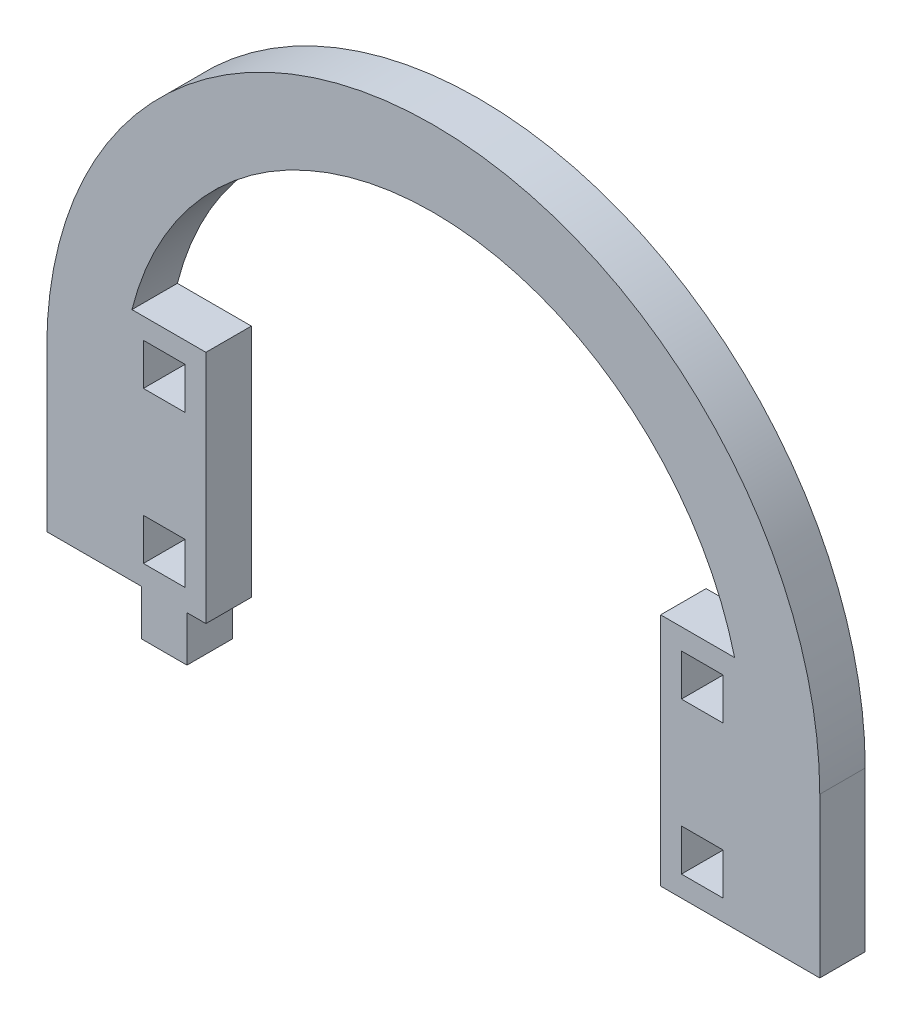
ISO-10303-21;
HEADER;
FILE_DESCRIPTION(('STEP AP214'),'2;1');
FILE_NAME('part.step','',(''),(''),'','','');
FILE_SCHEMA(('AUTOMOTIVE_DESIGN { 1 0 10303 214 1 1 1 1 }'));
ENDSEC;
DATA;
#1=APPLICATION_CONTEXT('core data for automotive mechanical design processes');
#2=APPLICATION_PROTOCOL_DEFINITION('international standard','automotive_design',2000,#1);
#3=PRODUCT_CONTEXT('',#1,'mechanical');
#4=PRODUCT('Part','Part','',(#3));
#5=PRODUCT_RELATED_PRODUCT_CATEGORY('part','',(#4));
#6=PRODUCT_DEFINITION_FORMATION('','',#4);
#7=PRODUCT_DEFINITION_CONTEXT('part definition',#1,'design');
#8=PRODUCT_DEFINITION('design','',#6,#7);
#9=PRODUCT_DEFINITION_SHAPE('','',#8);
#10=(LENGTH_UNIT() NAMED_UNIT(*) SI_UNIT(.MILLI.,.METRE.));
#11=(NAMED_UNIT(*) PLANE_ANGLE_UNIT() SI_UNIT($,.RADIAN.));
#12=(NAMED_UNIT(*) SI_UNIT($,.STERADIAN.) SOLID_ANGLE_UNIT());
#13=UNCERTAINTY_MEASURE_WITH_UNIT(LENGTH_MEASURE(1.E-05),#10,'distance_accuracy_value','');
#14=(GEOMETRIC_REPRESENTATION_CONTEXT(3) GLOBAL_UNCERTAINTY_ASSIGNED_CONTEXT((#13)) GLOBAL_UNIT_ASSIGNED_CONTEXT((#10,
#11,#12)) REPRESENTATION_CONTEXT('',''));
#15=CARTESIAN_POINT('',(0.,0.,0.));
#16=DIRECTION('',(0.,0.,1.));
#17=DIRECTION('',(1.,0.,0.));
#18=AXIS2_PLACEMENT_3D('',#15,#16,#17);
#19=CARTESIAN_POINT('',(3464.84300206341,1402.04996932109,6.));
#20=DIRECTION('',(0.,0.,1.));
#21=DIRECTION('',(1.,0.,0.));
#22=AXIS2_PLACEMENT_3D('',#19,#20,#21);
#23=PLANE('',#22);
#24=CARTESIAN_POINT('',(3464.84300206341,1402.04996932109,6.));
#25=DIRECTION('',(0.,0.,1.));
#26=DIRECTION('',(1.,0.,0.));
#27=AXIS2_PLACEMENT_3D('',#24,#25,#26);
#28=CIRCLE('',#27,51.0000000000002);
#29=CARTESIAN_POINT('',(3515.84300206341,1402.04996932109,6.));
#30=VERTEX_POINT('',#29);
#31=CARTESIAN_POINT('',(3413.84300206341,1402.04996932109,6.));
#32=VERTEX_POINT('',#31);
#33=EDGE_CURVE('E642',#30,#32,#28,.T.);
#34=ORIENTED_EDGE('',*,*,#33,.T.);
#35=DIRECTION('',(0.,-1.,0.));
#36=VECTOR('',#35,1.);
#37=CARTESIAN_POINT('',(3413.84300206341,1402.04996932109,6.));
#38=LINE('',#37,#36);
#39=CARTESIAN_POINT('',(3413.84300206341,1381.04996932109,6.));
#40=VERTEX_POINT('',#39);
#41=EDGE_CURVE('E646',#32,#40,#38,.T.);
#42=ORIENTED_EDGE('',*,*,#41,.T.);
#43=DIRECTION('',(1.,0.,0.));
#44=VECTOR('',#43,1.);
#45=CARTESIAN_POINT('',(3413.84300206341,1381.04996932109,6.));
#46=LINE('',#45,#44);
#47=CARTESIAN_POINT('',(3426.34300206341,1381.04996932109,6.));
#48=VERTEX_POINT('',#47);
#49=EDGE_CURVE('E650',#40,#48,#46,.T.);
#50=ORIENTED_EDGE('',*,*,#49,.T.);
#51=DIRECTION('',(0.,-1.,0.));
#52=VECTOR('',#51,1.);
#53=CARTESIAN_POINT('',(3426.34300206341,1381.04996932109,6.));
#54=LINE('',#53,#52);
#55=CARTESIAN_POINT('',(3426.34300206341,1375.04996932109,6.));
#56=VERTEX_POINT('',#55);
#57=EDGE_CURVE('E653',#48,#56,#54,.T.);
#58=ORIENTED_EDGE('',*,*,#57,.T.);
#59=DIRECTION('',(1.,0.,0.));
#60=VECTOR('',#59,1.);
#61=CARTESIAN_POINT('',(3426.34300206341,1375.04996932109,6.));
#62=LINE('',#61,#60);
#63=CARTESIAN_POINT('',(3432.34300206341,1375.04996932109,6.));
#64=VERTEX_POINT('',#63);
#65=EDGE_CURVE('E656',#56,#64,#62,.T.);
#66=ORIENTED_EDGE('',*,*,#65,.T.);
#67=DIRECTION('',(0.,1.,0.));
#68=VECTOR('',#67,1.);
#69=CARTESIAN_POINT('',(3432.34300206341,1375.04996932109,6.));
#70=LINE('',#69,#68);
#71=CARTESIAN_POINT('',(3432.34300206341,1381.04996932109,6.));
#72=VERTEX_POINT('',#71);
#73=EDGE_CURVE('E659',#64,#72,#70,.T.);
#74=ORIENTED_EDGE('',*,*,#73,.T.);
#75=DIRECTION('',(1.,0.,0.));
#76=VECTOR('',#75,1.);
#77=CARTESIAN_POINT('',(3432.34300206341,1381.04996932109,6.));
#78=LINE('',#77,#76);
#79=CARTESIAN_POINT('',(3434.84300206341,1381.04996932109,6.));
#80=VERTEX_POINT('',#79);
#81=EDGE_CURVE('E662',#72,#80,#78,.T.);
#82=ORIENTED_EDGE('',*,*,#81,.T.);
#83=DIRECTION('',(0.,-1.,0.));
#84=VECTOR('',#83,1.);
#85=CARTESIAN_POINT('',(3434.84300206341,1412.04996932109,6.));
#86=LINE('',#85,#84);
#87=CARTESIAN_POINT('',(3434.84300206341,1412.04996932109,6.));
#88=VERTEX_POINT('',#87);
#89=EDGE_CURVE('E665',#88,#80,#86,.T.);
#90=ORIENTED_EDGE('',*,*,#89,.F.);
#91=DIRECTION('',(-1.,0.,0.));
#92=VECTOR('',#91,1.);
#93=CARTESIAN_POINT('',(3434.84300206341,1412.04996932109,6.));
#94=LINE('',#93,#92);
#95=CARTESIAN_POINT('',(3425.08121135927,1412.04996932109,6.));
#96=VERTEX_POINT('',#95);
#97=EDGE_CURVE('E669',#88,#96,#94,.T.);
#98=ORIENTED_EDGE('',*,*,#97,.T.);
#99=CARTESIAN_POINT('',(3464.84300206341,1402.04996932109,6.));
#100=DIRECTION('',(0.,0.,1.));
#101=DIRECTION('',(1.,0.,0.));
#102=AXIS2_PLACEMENT_3D('',#99,#100,#101);
#103=CIRCLE('',#102,41.);
#104=CARTESIAN_POINT('',(3504.60479276755,1412.04996932109,6.));
#105=VERTEX_POINT('',#104);
#106=EDGE_CURVE('E672',#105,#96,#103,.T.);
#107=ORIENTED_EDGE('',*,*,#106,.F.);
#108=DIRECTION('',(-1.,0.,0.));
#109=VECTOR('',#108,1.);
#110=CARTESIAN_POINT('',(3504.60479276755,1412.04996932109,6.));
#111=LINE('',#110,#109);
#112=CARTESIAN_POINT('',(3494.84300206341,1412.04996932109,6.));
#113=VERTEX_POINT('',#112);
#114=EDGE_CURVE('E676',#105,#113,#111,.T.);
#115=ORIENTED_EDGE('',*,*,#114,.T.);
#116=DIRECTION('',(0.,-1.,0.));
#117=VECTOR('',#116,1.);
#118=CARTESIAN_POINT('',(3494.84300206341,1412.04996932109,6.));
#119=LINE('',#118,#117);
#120=CARTESIAN_POINT('',(3494.84300206341,1381.04996932109,6.));
#121=VERTEX_POINT('',#120);
#122=EDGE_CURVE('E679',#113,#121,#119,.T.);
#123=ORIENTED_EDGE('',*,*,#122,.T.);
#124=DIRECTION('',(1.,0.,0.));
#125=VECTOR('',#124,1.);
#126=CARTESIAN_POINT('',(3494.84300206341,1381.04996932109,6.));
#127=LINE('',#126,#125);
#128=CARTESIAN_POINT('',(3515.84300206341,1381.04996932109,6.));
#129=VERTEX_POINT('',#128);
#130=EDGE_CURVE('E682',#121,#129,#127,.T.);
#131=ORIENTED_EDGE('',*,*,#130,.T.);
#132=DIRECTION('',(0.,-1.,0.));
#133=VECTOR('',#132,1.);
#134=CARTESIAN_POINT('',(3515.84300206341,1402.04996932109,6.));
#135=LINE('',#134,#133);
#136=EDGE_CURVE('E685',#30,#129,#135,.T.);
#137=ORIENTED_EDGE('',*,*,#136,.F.);
#138=EDGE_LOOP('',(#34,#42,#50,#58,#66,#74,#82,#90,#98,#107,#115,#123,#131,#137));
#139=FACE_BOUND('',#138,.T.);
#140=DIRECTION('',(0.,1.,0.));
#141=VECTOR('',#140,1.);
#142=CARTESIAN_POINT('',(3432.09300206341,0.,6.));
#143=LINE('',#142,#141);
#144=CARTESIAN_POINT('',(3432.09300206341,1403.79996932109,6.));
#145=VERTEX_POINT('',#144);
#146=CARTESIAN_POINT('',(3432.09300206341,1409.29996932109,6.));
#147=VERTEX_POINT('',#146);
#148=EDGE_CURVE('E602',#145,#147,#143,.T.);
#149=ORIENTED_EDGE('',*,*,#148,.F.);
#150=DIRECTION('',(1.,0.,0.));
#151=VECTOR('',#150,1.);
#152=CARTESIAN_POINT('',(0.,1403.79996932109,6.));
#153=LINE('',#152,#151);
#154=CARTESIAN_POINT('',(3426.59300206341,1403.79996932109,6.));
#155=VERTEX_POINT('',#154);
#156=EDGE_CURVE('E599',#155,#145,#153,.T.);
#157=ORIENTED_EDGE('',*,*,#156,.F.);
#158=DIRECTION('',(0.,-1.,0.));
#159=VECTOR('',#158,1.);
#160=CARTESIAN_POINT('',(3426.59300206341,0.,6.));
#161=LINE('',#160,#159);
#162=CARTESIAN_POINT('',(3426.59300206341,1409.29996932109,6.));
#163=VERTEX_POINT('',#162);
#164=EDGE_CURVE('E610',#163,#155,#161,.T.);
#165=ORIENTED_EDGE('',*,*,#164,.F.);
#166=DIRECTION('',(-1.,0.,0.));
#167=VECTOR('',#166,1.);
#168=CARTESIAN_POINT('',(0.,1409.29996932109,6.));
#169=LINE('',#168,#167);
#170=EDGE_CURVE('E606',#147,#163,#169,.T.);
#171=ORIENTED_EDGE('',*,*,#170,.F.);
#172=EDGE_LOOP('',(#149,#157,#165,#171));
#173=FACE_BOUND('',#172,.T.);
#174=DIRECTION('',(0.,1.,0.));
#175=VECTOR('',#174,1.);
#176=CARTESIAN_POINT('',(3503.09300206341,0.,6.));
#177=LINE('',#176,#175);
#178=CARTESIAN_POINT('',(3503.09300206341,1383.79996932109,6.));
#179=VERTEX_POINT('',#178);
#180=CARTESIAN_POINT('',(3503.09300206341,1389.29996932109,6.));
#181=VERTEX_POINT('',#180);
#182=EDGE_CURVE('E559',#179,#181,#177,.T.);
#183=ORIENTED_EDGE('',*,*,#182,.F.);
#184=DIRECTION('',(1.,0.,0.));
#185=VECTOR('',#184,1.);
#186=CARTESIAN_POINT('',(0.,1383.79996932109,6.));
#187=LINE('',#186,#185);
#188=CARTESIAN_POINT('',(3497.59300206341,1383.79996932109,6.));
#189=VERTEX_POINT('',#188);
#190=EDGE_CURVE('E556',#189,#179,#187,.T.);
#191=ORIENTED_EDGE('',*,*,#190,.F.);
#192=DIRECTION('',(0.,-1.,0.));
#193=VECTOR('',#192,1.);
#194=CARTESIAN_POINT('',(3497.59300206341,0.,6.));
#195=LINE('',#194,#193);
#196=CARTESIAN_POINT('',(3497.59300206341,1389.29996932109,6.));
#197=VERTEX_POINT('',#196);
#198=EDGE_CURVE('E567',#197,#189,#195,.T.);
#199=ORIENTED_EDGE('',*,*,#198,.F.);
#200=DIRECTION('',(-1.,0.,0.));
#201=VECTOR('',#200,1.);
#202=CARTESIAN_POINT('',(0.,1389.29996932109,6.));
#203=LINE('',#202,#201);
#204=EDGE_CURVE('E563',#181,#197,#203,.T.);
#205=ORIENTED_EDGE('',*,*,#204,.F.);
#206=EDGE_LOOP('',(#183,#191,#199,#205));
#207=FACE_BOUND('',#206,.T.);
#208=DIRECTION('',(-1.,0.,0.));
#209=VECTOR('',#208,1.);
#210=CARTESIAN_POINT('',(3432.09300206341,1389.29996932109,6.));
#211=LINE('',#210,#209);
#212=CARTESIAN_POINT('',(3432.09300206341,1389.29996932109,6.));
#213=VERTEX_POINT('',#212);
#214=CARTESIAN_POINT('',(3426.59300206341,1389.29996932109,6.));
#215=VERTEX_POINT('',#214);
#216=EDGE_CURVE('E516',#213,#215,#211,.T.);
#217=ORIENTED_EDGE('',*,*,#216,.F.);
#218=DIRECTION('',(0.,1.,0.));
#219=VECTOR('',#218,1.);
#220=CARTESIAN_POINT('',(3432.09300206341,1383.79996932109,6.));
#221=LINE('',#220,#219);
#222=CARTESIAN_POINT('',(3432.09300206341,1383.79996932109,6.));
#223=VERTEX_POINT('',#222);
#224=EDGE_CURVE('E513',#223,#213,#221,.T.);
#225=ORIENTED_EDGE('',*,*,#224,.F.);
#226=DIRECTION('',(1.,0.,0.));
#227=VECTOR('',#226,1.);
#228=CARTESIAN_POINT('',(3426.59300206341,1383.79996932109,6.));
#229=LINE('',#228,#227);
#230=CARTESIAN_POINT('',(3426.59300206341,1383.79996932109,6.));
#231=VERTEX_POINT('',#230);
#232=EDGE_CURVE('E524',#231,#223,#229,.T.);
#233=ORIENTED_EDGE('',*,*,#232,.F.);
#234=DIRECTION('',(0.,-1.,0.));
#235=VECTOR('',#234,1.);
#236=CARTESIAN_POINT('',(3426.59300206341,1389.29996932109,6.));
#237=LINE('',#236,#235);
#238=EDGE_CURVE('E520',#215,#231,#237,.T.);
#239=ORIENTED_EDGE('',*,*,#238,.F.);
#240=EDGE_LOOP('',(#217,#225,#233,#239));
#241=FACE_BOUND('',#240,.T.);
#242=DIRECTION('',(0.,1.,0.));
#243=VECTOR('',#242,1.);
#244=CARTESIAN_POINT('',(3503.09300206341,1403.79996932109,6.));
#245=LINE('',#244,#243);
#246=CARTESIAN_POINT('',(3503.09300206341,1403.79996932109,6.));
#247=VERTEX_POINT('',#246);
#248=CARTESIAN_POINT('',(3503.09300206341,1409.29996932109,6.));
#249=VERTEX_POINT('',#248);
#250=EDGE_CURVE('E474',#247,#249,#245,.T.);
#251=ORIENTED_EDGE('',*,*,#250,.F.);
#252=DIRECTION('',(1.,0.,0.));
#253=VECTOR('',#252,1.);
#254=CARTESIAN_POINT('',(3497.59300206341,1403.79996932109,6.));
#255=LINE('',#254,#253);
#256=CARTESIAN_POINT('',(3497.59300206341,1403.79996932109,6.));
#257=VERTEX_POINT('',#256);
#258=EDGE_CURVE('E465',#257,#247,#255,.T.);
#259=ORIENTED_EDGE('',*,*,#258,.F.);
#260=DIRECTION('',(0.,-1.,0.));
#261=VECTOR('',#260,1.);
#262=CARTESIAN_POINT('',(3497.59300206341,1409.29996932109,6.));
#263=LINE('',#262,#261);
#264=CARTESIAN_POINT('',(3497.59300206341,1409.29996932109,6.));
#265=VERTEX_POINT('',#264);
#266=EDGE_CURVE('E491',#265,#257,#263,.T.);
#267=ORIENTED_EDGE('',*,*,#266,.F.);
#268=DIRECTION('',(-1.,0.,0.));
#269=VECTOR('',#268,1.);
#270=CARTESIAN_POINT('',(3503.09300206341,1409.29996932109,6.));
#271=LINE('',#270,#269);
#272=EDGE_CURVE('E487',#249,#265,#271,.T.);
#273=ORIENTED_EDGE('',*,*,#272,.F.);
#274=EDGE_LOOP('',(#251,#259,#267,#273));
#275=FACE_BOUND('',#274,.T.);
#276=ADVANCED_FACE('F267',(#139,#173,#207,#241,#275),#23,.T.);
#277=CARTESIAN_POINT('',(3464.84300206341,1402.04996932109,0.));
#278=DIRECTION('',(0.,0.,1.));
#279=DIRECTION('',(1.,0.,0.));
#280=AXIS2_PLACEMENT_3D('',#277,#278,#279);
#281=PLANE('',#280);
#282=DIRECTION('',(0.,1.,0.));
#283=VECTOR('',#282,1.);
#284=CARTESIAN_POINT('',(3432.09300206341,1383.79996932109,0.));
#285=LINE('',#284,#283);
#286=CARTESIAN_POINT('',(3432.09300206341,1383.79996932109,0.));
#287=VERTEX_POINT('',#286);
#288=CARTESIAN_POINT('',(3432.09300206341,1389.29996932109,0.));
#289=VERTEX_POINT('',#288);
#290=EDGE_CURVE('E483',#287,#289,#285,.T.);
#291=ORIENTED_EDGE('',*,*,#290,.T.);
#292=DIRECTION('',(-1.,0.,0.));
#293=VECTOR('',#292,1.);
#294=CARTESIAN_POINT('',(3432.09300206341,1389.29996932109,0.));
#295=LINE('',#294,#293);
#296=CARTESIAN_POINT('',(3426.59300206341,1389.29996932109,0.));
#297=VERTEX_POINT('',#296);
#298=EDGE_CURVE('E531',#289,#297,#295,.T.);
#299=ORIENTED_EDGE('',*,*,#298,.T.);
#300=DIRECTION('',(0.,-1.,0.));
#301=VECTOR('',#300,1.);
#302=CARTESIAN_POINT('',(3426.59300206341,1389.29996932109,0.));
#303=LINE('',#302,#301);
#304=CARTESIAN_POINT('',(3426.59300206341,1383.79996932109,0.));
#305=VERTEX_POINT('',#304);
#306=EDGE_CURVE('E535',#297,#305,#303,.T.);
#307=ORIENTED_EDGE('',*,*,#306,.T.);
#308=DIRECTION('',(1.,0.,0.));
#309=VECTOR('',#308,1.);
#310=CARTESIAN_POINT('',(3426.59300206341,1383.79996932109,0.));
#311=LINE('',#310,#309);
#312=EDGE_CURVE('E517',#305,#287,#311,.T.);
#313=ORIENTED_EDGE('',*,*,#312,.T.);
#314=EDGE_LOOP('',(#291,#299,#307,#313));
#315=FACE_BOUND('',#314,.T.);
#316=DIRECTION('',(1.,0.,0.));
#317=VECTOR('',#316,1.);
#318=CARTESIAN_POINT('',(0.,1403.79996932109,0.));
#319=LINE('',#318,#317);
#320=CARTESIAN_POINT('',(3426.59300206341,1403.79996932109,0.));
#321=VERTEX_POINT('',#320);
#322=CARTESIAN_POINT('',(3432.09300206341,1403.79996932109,0.));
#323=VERTEX_POINT('',#322);
#324=EDGE_CURVE('E598',#321,#323,#319,.T.);
#325=ORIENTED_EDGE('',*,*,#324,.T.);
#326=DIRECTION('',(0.,1.,0.));
#327=VECTOR('',#326,1.);
#328=CARTESIAN_POINT('',(3432.09300206341,0.,0.));
#329=LINE('',#328,#327);
#330=CARTESIAN_POINT('',(3432.09300206341,1409.29996932109,0.));
#331=VERTEX_POINT('',#330);
#332=EDGE_CURVE('E617',#323,#331,#329,.T.);
#333=ORIENTED_EDGE('',*,*,#332,.T.);
#334=DIRECTION('',(-1.,0.,0.));
#335=VECTOR('',#334,1.);
#336=CARTESIAN_POINT('',(0.,1409.29996932109,0.));
#337=LINE('',#336,#335);
#338=CARTESIAN_POINT('',(3426.59300206341,1409.29996932109,0.));
#339=VERTEX_POINT('',#338);
#340=EDGE_CURVE('E621',#331,#339,#337,.T.);
#341=ORIENTED_EDGE('',*,*,#340,.T.);
#342=DIRECTION('',(0.,-1.,0.));
#343=VECTOR('',#342,1.);
#344=CARTESIAN_POINT('',(3426.59300206341,0.,0.));
#345=LINE('',#344,#343);
#346=EDGE_CURVE('E603',#339,#321,#345,.T.);
#347=ORIENTED_EDGE('',*,*,#346,.T.);
#348=EDGE_LOOP('',(#325,#333,#341,#347));
#349=FACE_BOUND('',#348,.T.);
#350=CARTESIAN_POINT('',(3464.84300206341,1402.04996932109,0.));
#351=DIRECTION('',(0.,0.,1.));
#352=DIRECTION('',(1.,0.,0.));
#353=AXIS2_PLACEMENT_3D('',#350,#351,#352);
#354=CIRCLE('',#353,51.0000000000002);
#355=CARTESIAN_POINT('',(3515.84300206341,1402.04996932109,0.));
#356=VERTEX_POINT('',#355);
#357=CARTESIAN_POINT('',(3413.84300206341,1402.04996932109,0.));
#358=VERTEX_POINT('',#357);
#359=EDGE_CURVE('E641',#356,#358,#354,.T.);
#360=ORIENTED_EDGE('',*,*,#359,.F.);
#361=DIRECTION('',(0.,-1.,0.));
#362=VECTOR('',#361,1.);
#363=CARTESIAN_POINT('',(3515.84300206341,1402.04996932109,0.));
#364=LINE('',#363,#362);
#365=CARTESIAN_POINT('',(3515.84300206341,1381.04996932109,0.));
#366=VERTEX_POINT('',#365);
#367=EDGE_CURVE('E647',#356,#366,#364,.T.);
#368=ORIENTED_EDGE('',*,*,#367,.T.);
#369=DIRECTION('',(-1.,0.,0.));
#370=VECTOR('',#369,1.);
#371=CARTESIAN_POINT('',(3515.84300206341,1381.04996932109,0.));
#372=LINE('',#371,#370);
#373=CARTESIAN_POINT('',(3494.84300206341,1381.04996932109,0.));
#374=VERTEX_POINT('',#373);
#375=EDGE_CURVE('E731',#366,#374,#372,.T.);
#376=ORIENTED_EDGE('',*,*,#375,.T.);
#377=DIRECTION('',(0.,-1.,0.));
#378=VECTOR('',#377,1.);
#379=CARTESIAN_POINT('',(3494.84300206341,1412.04996932109,0.));
#380=LINE('',#379,#378);
#381=CARTESIAN_POINT('',(3494.84300206341,1412.04996932109,0.));
#382=VERTEX_POINT('',#381);
#383=EDGE_CURVE('E727',#382,#374,#380,.T.);
#384=ORIENTED_EDGE('',*,*,#383,.F.);
#385=DIRECTION('',(-1.,0.,0.));
#386=VECTOR('',#385,1.);
#387=CARTESIAN_POINT('',(3504.60479276755,1412.04996932109,0.));
#388=LINE('',#387,#386);
#389=CARTESIAN_POINT('',(3504.60479276755,1412.04996932109,0.));
#390=VERTEX_POINT('',#389);
#391=EDGE_CURVE('E724',#390,#382,#388,.T.);
#392=ORIENTED_EDGE('',*,*,#391,.F.);
#393=CARTESIAN_POINT('',(3464.84300206341,1402.04996932109,0.));
#394=DIRECTION('',(0.,0.,1.));
#395=DIRECTION('',(1.,0.,0.));
#396=AXIS2_PLACEMENT_3D('',#393,#394,#395);
#397=CIRCLE('',#396,41.);
#398=CARTESIAN_POINT('',(3425.08121135927,1412.04996932109,0.));
#399=VERTEX_POINT('',#398);
#400=EDGE_CURVE('E720',#390,#399,#397,.T.);
#401=ORIENTED_EDGE('',*,*,#400,.T.);
#402=DIRECTION('',(-1.,0.,0.));
#403=VECTOR('',#402,1.);
#404=CARTESIAN_POINT('',(3434.84300206341,1412.04996932109,0.));
#405=LINE('',#404,#403);
#406=CARTESIAN_POINT('',(3434.84300206341,1412.04996932109,0.));
#407=VERTEX_POINT('',#406);
#408=EDGE_CURVE('E716',#407,#399,#405,.T.);
#409=ORIENTED_EDGE('',*,*,#408,.F.);
#410=DIRECTION('',(0.,-1.,0.));
#411=VECTOR('',#410,1.);
#412=CARTESIAN_POINT('',(3434.84300206341,1412.04996932109,0.));
#413=LINE('',#412,#411);
#414=CARTESIAN_POINT('',(3434.84300206341,1381.04996932109,0.));
#415=VERTEX_POINT('',#414);
#416=EDGE_CURVE('E712',#407,#415,#413,.T.);
#417=ORIENTED_EDGE('',*,*,#416,.T.);
#418=DIRECTION('',(1.,0.,0.));
#419=VECTOR('',#418,1.);
#420=CARTESIAN_POINT('',(3432.34300206341,1381.04996932109,0.));
#421=LINE('',#420,#419);
#422=CARTESIAN_POINT('',(3432.34300206341,1381.04996932109,0.));
#423=VERTEX_POINT('',#422);
#424=EDGE_CURVE('E708',#423,#415,#421,.T.);
#425=ORIENTED_EDGE('',*,*,#424,.F.);
#426=DIRECTION('',(0.,1.,0.));
#427=VECTOR('',#426,1.);
#428=CARTESIAN_POINT('',(3432.34300206341,1375.04996932109,0.));
#429=LINE('',#428,#427);
#430=CARTESIAN_POINT('',(3432.34300206341,1375.04996932109,0.));
#431=VERTEX_POINT('',#430);
#432=EDGE_CURVE('E705',#431,#423,#429,.T.);
#433=ORIENTED_EDGE('',*,*,#432,.F.);
#434=DIRECTION('',(1.,0.,0.));
#435=VECTOR('',#434,1.);
#436=CARTESIAN_POINT('',(3426.34300206341,1375.04996932109,0.));
#437=LINE('',#436,#435);
#438=CARTESIAN_POINT('',(3426.34300206341,1375.04996932109,0.));
#439=VERTEX_POINT('',#438);
#440=EDGE_CURVE('E702',#439,#431,#437,.T.);
#441=ORIENTED_EDGE('',*,*,#440,.F.);
#442=DIRECTION('',(0.,-1.,0.));
#443=VECTOR('',#442,1.);
#444=CARTESIAN_POINT('',(3426.34300206341,1381.04996932109,0.));
#445=LINE('',#444,#443);
#446=CARTESIAN_POINT('',(3426.34300206341,1381.04996932109,0.));
#447=VERTEX_POINT('',#446);
#448=EDGE_CURVE('E699',#447,#439,#445,.T.);
#449=ORIENTED_EDGE('',*,*,#448,.F.);
#450=DIRECTION('',(1.,0.,0.));
#451=VECTOR('',#450,1.);
#452=CARTESIAN_POINT('',(3413.84300206341,1381.04996932109,0.));
#453=LINE('',#452,#451);
#454=CARTESIAN_POINT('',(3413.84300206341,1381.04996932109,0.));
#455=VERTEX_POINT('',#454);
#456=EDGE_CURVE('E696',#455,#447,#453,.T.);
#457=ORIENTED_EDGE('',*,*,#456,.F.);
#458=DIRECTION('',(0.,-1.,0.));
#459=VECTOR('',#458,1.);
#460=CARTESIAN_POINT('',(3413.84300206341,1402.04996932109,0.));
#461=LINE('',#460,#459);
#462=EDGE_CURVE('E693',#358,#455,#461,.T.);
#463=ORIENTED_EDGE('',*,*,#462,.F.);
#464=EDGE_LOOP('',(#360,#368,#376,#384,#392,#401,#409,#417,#425,#433,#441,#449,#457,#463));
#465=FACE_BOUND('',#464,.T.);
#466=DIRECTION('',(1.,0.,0.));
#467=VECTOR('',#466,1.);
#468=CARTESIAN_POINT('',(0.,1383.79996932109,0.));
#469=LINE('',#468,#467);
#470=CARTESIAN_POINT('',(3497.59300206341,1383.79996932109,0.));
#471=VERTEX_POINT('',#470);
#472=CARTESIAN_POINT('',(3503.09300206341,1383.79996932109,0.));
#473=VERTEX_POINT('',#472);
#474=EDGE_CURVE('E555',#471,#473,#469,.T.);
#475=ORIENTED_EDGE('',*,*,#474,.T.);
#476=DIRECTION('',(0.,1.,0.));
#477=VECTOR('',#476,1.);
#478=CARTESIAN_POINT('',(3503.09300206341,0.,0.));
#479=LINE('',#478,#477);
#480=CARTESIAN_POINT('',(3503.09300206341,1389.29996932109,0.));
#481=VERTEX_POINT('',#480);
#482=EDGE_CURVE('E574',#473,#481,#479,.T.);
#483=ORIENTED_EDGE('',*,*,#482,.T.);
#484=DIRECTION('',(-1.,0.,0.));
#485=VECTOR('',#484,1.);
#486=CARTESIAN_POINT('',(0.,1389.29996932109,0.));
#487=LINE('',#486,#485);
#488=CARTESIAN_POINT('',(3497.59300206341,1389.29996932109,0.));
#489=VERTEX_POINT('',#488);
#490=EDGE_CURVE('E578',#481,#489,#487,.T.);
#491=ORIENTED_EDGE('',*,*,#490,.T.);
#492=DIRECTION('',(0.,-1.,0.));
#493=VECTOR('',#492,1.);
#494=CARTESIAN_POINT('',(3497.59300206341,0.,0.));
#495=LINE('',#494,#493);
#496=EDGE_CURVE('E560',#489,#471,#495,.T.);
#497=ORIENTED_EDGE('',*,*,#496,.T.);
#498=EDGE_LOOP('',(#475,#483,#491,#497));
#499=FACE_BOUND('',#498,.T.);
#500=DIRECTION('',(1.,0.,0.));
#501=VECTOR('',#500,1.);
#502=CARTESIAN_POINT('',(3497.59300206341,1403.79996932109,0.));
#503=LINE('',#502,#501);
#504=CARTESIAN_POINT('',(3497.59300206341,1403.79996932109,0.));
#505=VERTEX_POINT('',#504);
#506=CARTESIAN_POINT('',(3503.09300206341,1403.79996932109,0.));
#507=VERTEX_POINT('',#506);
#508=EDGE_CURVE('E291',#505,#507,#503,.T.);
#509=ORIENTED_EDGE('',*,*,#508,.T.);
#510=DIRECTION('',(0.,1.,0.));
#511=VECTOR('',#510,1.);
#512=CARTESIAN_POINT('',(3503.09300206341,1403.79996932109,0.));
#513=LINE('',#512,#511);
#514=CARTESIAN_POINT('',(3503.09300206341,1409.29996932109,0.));
#515=VERTEX_POINT('',#514);
#516=EDGE_CURVE('E481',#507,#515,#513,.T.);
#517=ORIENTED_EDGE('',*,*,#516,.T.);
#518=DIRECTION('',(-1.,0.,0.));
#519=VECTOR('',#518,1.);
#520=CARTESIAN_POINT('',(3503.09300206341,1409.29996932109,0.));
#521=LINE('',#520,#519);
#522=CARTESIAN_POINT('',(3497.59300206341,1409.29996932109,0.));
#523=VERTEX_POINT('',#522);
#524=EDGE_CURVE('E500',#515,#523,#521,.T.);
#525=ORIENTED_EDGE('',*,*,#524,.T.);
#526=DIRECTION('',(0.,-1.,0.));
#527=VECTOR('',#526,1.);
#528=CARTESIAN_POINT('',(3497.59300206341,1409.29996932109,0.));
#529=LINE('',#528,#527);
#530=EDGE_CURVE('E475',#523,#505,#529,.T.);
#531=ORIENTED_EDGE('',*,*,#530,.T.);
#532=EDGE_LOOP('',(#509,#517,#525,#531));
#533=FACE_BOUND('',#532,.T.);
#534=ADVANCED_FACE('F789',(#315,#349,#465,#499,#533),#281,.F.);
#535=CARTESIAN_POINT('',(3464.84300206341,1402.04996932109,6.));
#536=DIRECTION('',(0.,0.,-1.));
#537=DIRECTION('',(-1.,0.,0.));
#538=AXIS2_PLACEMENT_3D('',#535,#536,#537);
#539=CYLINDRICAL_SURFACE('',#538,51.0000000000002);
#540=ORIENTED_EDGE('',*,*,#359,.T.);
#541=DIRECTION('',(0.,0.,-1.));
#542=VECTOR('',#541,1.);
#543=CARTESIAN_POINT('',(3413.84300206341,1402.04996932109,6.));
#544=LINE('',#543,#542);
#545=EDGE_CURVE('E12',#32,#358,#544,.T.);
#546=ORIENTED_EDGE('',*,*,#545,.F.);
#547=ORIENTED_EDGE('',*,*,#33,.F.);
#548=DIRECTION('',(0.,0.,-1.));
#549=VECTOR('',#548,1.);
#550=CARTESIAN_POINT('',(3515.84300206341,1402.04996932109,6.));
#551=LINE('',#550,#549);
#552=EDGE_CURVE('E689',#30,#356,#551,.T.);
#553=ORIENTED_EDGE('',*,*,#552,.T.);
#554=EDGE_LOOP('',(#540,#546,#547,#553));
#555=FACE_BOUND('',#554,.T.);
#556=ADVANCED_FACE('F269',(#555),#539,.T.);
#557=CARTESIAN_POINT('',(3413.84300206341,1402.04996932109,6.));
#558=DIRECTION('',(1.,0.,0.));
#559=DIRECTION('',(0.,0.,-1.));
#560=AXIS2_PLACEMENT_3D('',#557,#558,#559);
#561=PLANE('',#560);
#562=ORIENTED_EDGE('',*,*,#462,.T.);
#563=DIRECTION('',(0.,0.,-1.));
#564=VECTOR('',#563,1.);
#565=CARTESIAN_POINT('',(3413.84300206341,1381.04996932109,6.));
#566=LINE('',#565,#564);
#567=EDGE_CURVE('E276',#40,#455,#566,.T.);
#568=ORIENTED_EDGE('',*,*,#567,.F.);
#569=ORIENTED_EDGE('',*,*,#41,.F.);
#570=ORIENTED_EDGE('',*,*,#545,.T.);
#571=EDGE_LOOP('',(#562,#568,#569,#570));
#572=FACE_BOUND('',#571,.T.);
#573=ADVANCED_FACE('F808',(#572),#561,.F.);
#574=CARTESIAN_POINT('',(3413.84300206341,1381.04996932109,6.));
#575=DIRECTION('',(0.,1.,0.));
#576=DIRECTION('',(0.,0.,1.));
#577=AXIS2_PLACEMENT_3D('',#574,#575,#576);
#578=PLANE('',#577);
#579=ORIENTED_EDGE('',*,*,#456,.T.);
#580=DIRECTION('',(0.,0.,-1.));
#581=VECTOR('',#580,1.);
#582=CARTESIAN_POINT('',(3426.34300206341,1381.04996932109,6.));
#583=LINE('',#582,#581);
#584=EDGE_CURVE('E774',#48,#447,#583,.T.);
#585=ORIENTED_EDGE('',*,*,#584,.F.);
#586=ORIENTED_EDGE('',*,*,#49,.F.);
#587=ORIENTED_EDGE('',*,*,#567,.T.);
#588=EDGE_LOOP('',(#579,#585,#586,#587));
#589=FACE_BOUND('',#588,.T.);
#590=ADVANCED_FACE('F783',(#589),#578,.F.);
#591=CARTESIAN_POINT('',(3426.34300206341,1381.04996932109,6.));
#592=DIRECTION('',(1.,0.,0.));
#593=DIRECTION('',(0.,0.,-1.));
#594=AXIS2_PLACEMENT_3D('',#591,#592,#593);
#595=PLANE('',#594);
#596=ORIENTED_EDGE('',*,*,#448,.T.);
#597=DIRECTION('',(0.,0.,-1.));
#598=VECTOR('',#597,1.);
#599=CARTESIAN_POINT('',(3426.34300206341,1375.04996932109,6.));
#600=LINE('',#599,#598);
#601=EDGE_CURVE('E770',#56,#439,#600,.T.);
#602=ORIENTED_EDGE('',*,*,#601,.F.);
#603=ORIENTED_EDGE('',*,*,#57,.F.);
#604=ORIENTED_EDGE('',*,*,#584,.T.);
#605=EDGE_LOOP('',(#596,#602,#603,#604));
#606=FACE_BOUND('',#605,.T.);
#607=ADVANCED_FACE('F795',(#606),#595,.F.);
#608=CARTESIAN_POINT('',(3426.34300206341,1375.04996932109,6.));
#609=DIRECTION('',(0.,1.,0.));
#610=DIRECTION('',(0.,0.,1.));
#611=AXIS2_PLACEMENT_3D('',#608,#609,#610);
#612=PLANE('',#611);
#613=ORIENTED_EDGE('',*,*,#440,.T.);
#614=DIRECTION('',(0.,0.,-1.));
#615=VECTOR('',#614,1.);
#616=CARTESIAN_POINT('',(3432.34300206341,1375.04996932109,6.));
#617=LINE('',#616,#615);
#618=EDGE_CURVE('E766',#64,#431,#617,.T.);
#619=ORIENTED_EDGE('',*,*,#618,.F.);
#620=ORIENTED_EDGE('',*,*,#65,.F.);
#621=ORIENTED_EDGE('',*,*,#601,.T.);
#622=EDGE_LOOP('',(#613,#619,#620,#621));
#623=FACE_BOUND('',#622,.T.);
#624=ADVANCED_FACE('F799',(#623),#612,.F.);
#625=CARTESIAN_POINT('',(3432.34300206341,1375.04996932109,6.));
#626=DIRECTION('',(-1.,0.,0.));
#627=DIRECTION('',(0.,0.,1.));
#628=AXIS2_PLACEMENT_3D('',#625,#626,#627);
#629=PLANE('',#628);
#630=ORIENTED_EDGE('',*,*,#432,.T.);
#631=DIRECTION('',(0.,0.,-1.));
#632=VECTOR('',#631,1.);
#633=CARTESIAN_POINT('',(3432.34300206341,1381.04996932109,6.));
#634=LINE('',#633,#632);
#635=EDGE_CURVE('E762',#72,#423,#634,.T.);
#636=ORIENTED_EDGE('',*,*,#635,.F.);
#637=ORIENTED_EDGE('',*,*,#73,.F.);
#638=ORIENTED_EDGE('',*,*,#618,.T.);
#639=EDGE_LOOP('',(#630,#636,#637,#638));
#640=FACE_BOUND('',#639,.T.);
#641=ADVANCED_FACE('F847',(#640),#629,.F.);
#642=CARTESIAN_POINT('',(3432.34300206341,1381.04996932109,6.));
#643=DIRECTION('',(0.,1.,0.));
#644=DIRECTION('',(0.,0.,1.));
#645=AXIS2_PLACEMENT_3D('',#642,#643,#644);
#646=PLANE('',#645);
#647=ORIENTED_EDGE('',*,*,#424,.T.);
#648=DIRECTION('',(0.,0.,-1.));
#649=VECTOR('',#648,1.);
#650=CARTESIAN_POINT('',(3434.84300206341,1381.04996932109,6.));
#651=LINE('',#650,#649);
#652=EDGE_CURVE('E759',#80,#415,#651,.T.);
#653=ORIENTED_EDGE('',*,*,#652,.F.);
#654=ORIENTED_EDGE('',*,*,#81,.F.);
#655=ORIENTED_EDGE('',*,*,#635,.T.);
#656=EDGE_LOOP('',(#647,#653,#654,#655));
#657=FACE_BOUND('',#656,.T.);
#658=ADVANCED_FACE('F845',(#657),#646,.F.);
#659=CARTESIAN_POINT('',(3434.84300206341,1412.04996932109,6.));
#660=DIRECTION('',(1.,0.,0.));
#661=DIRECTION('',(0.,0.,-1.));
#662=AXIS2_PLACEMENT_3D('',#659,#660,#661);
#663=PLANE('',#662);
#664=ORIENTED_EDGE('',*,*,#416,.F.);
#665=DIRECTION('',(0.,0.,-1.));
#666=VECTOR('',#665,1.);
#667=CARTESIAN_POINT('',(3434.84300206341,1412.04996932109,6.));
#668=LINE('',#667,#666);
#669=EDGE_CURVE('E756',#88,#407,#668,.T.);
#670=ORIENTED_EDGE('',*,*,#669,.F.);
#671=ORIENTED_EDGE('',*,*,#89,.T.);
#672=ORIENTED_EDGE('',*,*,#652,.T.);
#673=EDGE_LOOP('',(#664,#670,#671,#672));
#674=FACE_BOUND('',#673,.T.);
#675=ADVANCED_FACE('F840',(#674),#663,.T.);
#676=CARTESIAN_POINT('',(3434.84300206341,1412.04996932109,6.));
#677=DIRECTION('',(0.,-1.,0.));
#678=DIRECTION('',(0.,0.,-1.));
#679=AXIS2_PLACEMENT_3D('',#676,#677,#678);
#680=PLANE('',#679);
#681=ORIENTED_EDGE('',*,*,#408,.T.);
#682=DIRECTION('',(0.,0.,-1.));
#683=VECTOR('',#682,1.);
#684=CARTESIAN_POINT('',(3425.08121135927,1412.04996932109,6.));
#685=LINE('',#684,#683);
#686=EDGE_CURVE('E753',#96,#399,#685,.T.);
#687=ORIENTED_EDGE('',*,*,#686,.F.);
#688=ORIENTED_EDGE('',*,*,#97,.F.);
#689=ORIENTED_EDGE('',*,*,#669,.T.);
#690=EDGE_LOOP('',(#681,#687,#688,#689));
#691=FACE_BOUND('',#690,.T.);
#692=ADVANCED_FACE('F836',(#691),#680,.F.);
#693=CARTESIAN_POINT('',(3464.84300206341,1402.04996932109,6.));
#694=DIRECTION('',(0.,0.,-1.));
#695=DIRECTION('',(-1.,0.,0.));
#696=AXIS2_PLACEMENT_3D('',#693,#694,#695);
#697=CYLINDRICAL_SURFACE('',#696,41.);
#698=ORIENTED_EDGE('',*,*,#400,.F.);
#699=DIRECTION('',(0.,0.,-1.));
#700=VECTOR('',#699,1.);
#701=CARTESIAN_POINT('',(3504.60479276755,1412.04996932109,6.));
#702=LINE('',#701,#700);
#703=EDGE_CURVE('E750',#105,#390,#702,.T.);
#704=ORIENTED_EDGE('',*,*,#703,.F.);
#705=ORIENTED_EDGE('',*,*,#106,.T.);
#706=ORIENTED_EDGE('',*,*,#686,.T.);
#707=EDGE_LOOP('',(#698,#704,#705,#706));
#708=FACE_BOUND('',#707,.T.);
#709=ADVANCED_FACE('F832',(#708),#697,.F.);
#710=CARTESIAN_POINT('',(3504.60479276755,1412.04996932109,6.));
#711=DIRECTION('',(0.,-1.,0.));
#712=DIRECTION('',(0.,0.,-1.));
#713=AXIS2_PLACEMENT_3D('',#710,#711,#712);
#714=PLANE('',#713);
#715=ORIENTED_EDGE('',*,*,#391,.T.);
#716=DIRECTION('',(0.,0.,-1.));
#717=VECTOR('',#716,1.);
#718=CARTESIAN_POINT('',(3494.84300206341,1412.04996932109,6.));
#719=LINE('',#718,#717);
#720=EDGE_CURVE('E746',#113,#382,#719,.T.);
#721=ORIENTED_EDGE('',*,*,#720,.F.);
#722=ORIENTED_EDGE('',*,*,#114,.F.);
#723=ORIENTED_EDGE('',*,*,#703,.T.);
#724=EDGE_LOOP('',(#715,#721,#722,#723));
#725=FACE_BOUND('',#724,.T.);
#726=ADVANCED_FACE('F827',(#725),#714,.F.);
#727=CARTESIAN_POINT('',(3494.84300206341,1412.04996932109,6.));
#728=DIRECTION('',(1.,0.,0.));
#729=DIRECTION('',(0.,0.,-1.));
#730=AXIS2_PLACEMENT_3D('',#727,#728,#729);
#731=PLANE('',#730);
#732=ORIENTED_EDGE('',*,*,#383,.T.);
#733=DIRECTION('',(0.,0.,-1.));
#734=VECTOR('',#733,1.);
#735=CARTESIAN_POINT('',(3494.84300206341,1381.04996932109,6.));
#736=LINE('',#735,#734);
#737=EDGE_CURVE('E742',#121,#374,#736,.T.);
#738=ORIENTED_EDGE('',*,*,#737,.F.);
#739=ORIENTED_EDGE('',*,*,#122,.F.);
#740=ORIENTED_EDGE('',*,*,#720,.T.);
#741=EDGE_LOOP('',(#732,#738,#739,#740));
#742=FACE_BOUND('',#741,.T.);
#743=ADVANCED_FACE('F822',(#742),#731,.F.);
#744=CARTESIAN_POINT('',(3515.84300206341,1381.04996932109,6.));
#745=DIRECTION('',(0.,-1.,0.));
#746=DIRECTION('',(0.,0.,-1.));
#747=AXIS2_PLACEMENT_3D('',#744,#745,#746);
#748=PLANE('',#747);
#749=ORIENTED_EDGE('',*,*,#375,.F.);
#750=DIRECTION('',(0.,0.,-1.));
#751=VECTOR('',#750,1.);
#752=CARTESIAN_POINT('',(3515.84300206341,1381.04996932109,6.));
#753=LINE('',#752,#751);
#754=EDGE_CURVE('E739',#129,#366,#753,.T.);
#755=ORIENTED_EDGE('',*,*,#754,.F.);
#756=ORIENTED_EDGE('',*,*,#130,.F.);
#757=ORIENTED_EDGE('',*,*,#737,.T.);
#758=EDGE_LOOP('',(#749,#755,#756,#757));
#759=FACE_BOUND('',#758,.T.);
#760=ADVANCED_FACE('F817',(#759),#748,.T.);
#761=CARTESIAN_POINT('',(3515.84300206341,1402.04996932109,6.));
#762=DIRECTION('',(1.,0.,0.));
#763=DIRECTION('',(0.,0.,-1.));
#764=AXIS2_PLACEMENT_3D('',#761,#762,#763);
#765=PLANE('',#764);
#766=ORIENTED_EDGE('',*,*,#367,.F.);
#767=ORIENTED_EDGE('',*,*,#552,.F.);
#768=ORIENTED_EDGE('',*,*,#136,.T.);
#769=ORIENTED_EDGE('',*,*,#754,.T.);
#770=EDGE_LOOP('',(#766,#767,#768,#769));
#771=FACE_BOUND('',#770,.T.);
#772=ADVANCED_FACE('F812',(#771),#765,.T.);
#773=CARTESIAN_POINT('',(0.,1403.79996932109,6.));
#774=DIRECTION('',(0.,1.,0.));
#775=DIRECTION('',(0.,0.,1.));
#776=AXIS2_PLACEMENT_3D('',#773,#774,#775);
#777=PLANE('',#776);
#778=ORIENTED_EDGE('',*,*,#324,.F.);
#779=DIRECTION('',(0.,0.,-1.));
#780=VECTOR('',#779,1.);
#781=CARTESIAN_POINT('',(3426.59300206341,1403.79996932109,6.));
#782=LINE('',#781,#780);
#783=EDGE_CURVE('E613',#155,#321,#782,.T.);
#784=ORIENTED_EDGE('',*,*,#783,.F.);
#785=ORIENTED_EDGE('',*,*,#156,.T.);
#786=DIRECTION('',(0.,0.,-1.));
#787=VECTOR('',#786,1.);
#788=CARTESIAN_POINT('',(3432.09300206341,1403.79996932109,6.));
#789=LINE('',#788,#787);
#790=EDGE_CURVE('E637',#145,#323,#789,.T.);
#791=ORIENTED_EDGE('',*,*,#790,.T.);
#792=EDGE_LOOP('',(#778,#784,#785,#791));
#793=FACE_BOUND('',#792,.T.);
#794=ADVANCED_FACE('F864',(#793),#777,.T.);
#795=CARTESIAN_POINT('',(3432.09300206341,0.,6.));
#796=DIRECTION('',(-1.,0.,0.));
#797=DIRECTION('',(0.,0.,1.));
#798=AXIS2_PLACEMENT_3D('',#795,#796,#797);
#799=PLANE('',#798);
#800=ORIENTED_EDGE('',*,*,#332,.F.);
#801=ORIENTED_EDGE('',*,*,#790,.F.);
#802=ORIENTED_EDGE('',*,*,#148,.T.);
#803=DIRECTION('',(0.,0.,-1.));
#804=VECTOR('',#803,1.);
#805=CARTESIAN_POINT('',(3432.09300206341,1409.29996932109,6.));
#806=LINE('',#805,#804);
#807=EDGE_CURVE('E634',#147,#331,#806,.T.);
#808=ORIENTED_EDGE('',*,*,#807,.T.);
#809=EDGE_LOOP('',(#800,#801,#802,#808));
#810=FACE_BOUND('',#809,.T.);
#811=ADVANCED_FACE('F914',(#810),#799,.T.);
#812=CARTESIAN_POINT('',(0.,1409.29996932109,6.));
#813=DIRECTION('',(0.,-1.,0.));
#814=DIRECTION('',(0.,0.,-1.));
#815=AXIS2_PLACEMENT_3D('',#812,#813,#814);
#816=PLANE('',#815);
#817=ORIENTED_EDGE('',*,*,#340,.F.);
#818=ORIENTED_EDGE('',*,*,#807,.F.);
#819=ORIENTED_EDGE('',*,*,#170,.T.);
#820=DIRECTION('',(0.,0.,-1.));
#821=VECTOR('',#820,1.);
#822=CARTESIAN_POINT('',(3426.59300206341,1409.29996932109,6.));
#823=LINE('',#822,#821);
#824=EDGE_CURVE('E631',#163,#339,#823,.T.);
#825=ORIENTED_EDGE('',*,*,#824,.T.);
#826=EDGE_LOOP('',(#817,#818,#819,#825));
#827=FACE_BOUND('',#826,.T.);
#828=ADVANCED_FACE('F921',(#827),#816,.T.);
#829=CARTESIAN_POINT('',(3426.59300206341,0.,6.));
#830=DIRECTION('',(1.,0.,0.));
#831=DIRECTION('',(0.,0.,-1.));
#832=AXIS2_PLACEMENT_3D('',#829,#830,#831);
#833=PLANE('',#832);
#834=ORIENTED_EDGE('',*,*,#346,.F.);
#835=ORIENTED_EDGE('',*,*,#824,.F.);
#836=ORIENTED_EDGE('',*,*,#164,.T.);
#837=ORIENTED_EDGE('',*,*,#783,.T.);
#838=EDGE_LOOP('',(#834,#835,#836,#837));
#839=FACE_BOUND('',#838,.T.);
#840=ADVANCED_FACE('F928',(#839),#833,.T.);
#841=CARTESIAN_POINT('',(0.,1383.79996932109,6.));
#842=DIRECTION('',(0.,1.,0.));
#843=DIRECTION('',(0.,0.,1.));
#844=AXIS2_PLACEMENT_3D('',#841,#842,#843);
#845=PLANE('',#844);
#846=ORIENTED_EDGE('',*,*,#474,.F.);
#847=DIRECTION('',(0.,0.,-1.));
#848=VECTOR('',#847,1.);
#849=CARTESIAN_POINT('',(3497.59300206341,1383.79996932109,6.));
#850=LINE('',#849,#848);
#851=EDGE_CURVE('E570',#189,#471,#850,.T.);
#852=ORIENTED_EDGE('',*,*,#851,.F.);
#853=ORIENTED_EDGE('',*,*,#190,.T.);
#854=DIRECTION('',(0.,0.,-1.));
#855=VECTOR('',#854,1.);
#856=CARTESIAN_POINT('',(3503.09300206341,1383.79996932109,6.));
#857=LINE('',#856,#855);
#858=EDGE_CURVE('E594',#179,#473,#857,.T.);
#859=ORIENTED_EDGE('',*,*,#858,.T.);
#860=EDGE_LOOP('',(#846,#852,#853,#859));
#861=FACE_BOUND('',#860,.T.);
#862=ADVANCED_FACE('F936',(#861),#845,.T.);
#863=CARTESIAN_POINT('',(3503.09300206341,0.,6.));
#864=DIRECTION('',(-1.,0.,0.));
#865=DIRECTION('',(0.,0.,1.));
#866=AXIS2_PLACEMENT_3D('',#863,#864,#865);
#867=PLANE('',#866);
#868=ORIENTED_EDGE('',*,*,#482,.F.);
#869=ORIENTED_EDGE('',*,*,#858,.F.);
#870=ORIENTED_EDGE('',*,*,#182,.T.);
#871=DIRECTION('',(0.,0.,-1.));
#872=VECTOR('',#871,1.);
#873=CARTESIAN_POINT('',(3503.09300206341,1389.29996932109,6.));
#874=LINE('',#873,#872);
#875=EDGE_CURVE('E591',#181,#481,#874,.T.);
#876=ORIENTED_EDGE('',*,*,#875,.T.);
#877=EDGE_LOOP('',(#868,#869,#870,#876));
#878=FACE_BOUND('',#877,.T.);
#879=ADVANCED_FACE('F944',(#878),#867,.T.);
#880=CARTESIAN_POINT('',(0.,1389.29996932109,6.));
#881=DIRECTION('',(0.,-1.,0.));
#882=DIRECTION('',(0.,0.,-1.));
#883=AXIS2_PLACEMENT_3D('',#880,#881,#882);
#884=PLANE('',#883);
#885=ORIENTED_EDGE('',*,*,#490,.F.);
#886=ORIENTED_EDGE('',*,*,#875,.F.);
#887=ORIENTED_EDGE('',*,*,#204,.T.);
#888=DIRECTION('',(0.,0.,-1.));
#889=VECTOR('',#888,1.);
#890=CARTESIAN_POINT('',(3497.59300206341,1389.29996932109,6.));
#891=LINE('',#890,#889);
#892=EDGE_CURVE('E588',#197,#489,#891,.T.);
#893=ORIENTED_EDGE('',*,*,#892,.T.);
#894=EDGE_LOOP('',(#885,#886,#887,#893));
#895=FACE_BOUND('',#894,.T.);
#896=ADVANCED_FACE('F952',(#895),#884,.T.);
#897=CARTESIAN_POINT('',(3497.59300206341,0.,6.));
#898=DIRECTION('',(1.,0.,0.));
#899=DIRECTION('',(0.,0.,-1.));
#900=AXIS2_PLACEMENT_3D('',#897,#898,#899);
#901=PLANE('',#900);
#902=ORIENTED_EDGE('',*,*,#496,.F.);
#903=ORIENTED_EDGE('',*,*,#892,.F.);
#904=ORIENTED_EDGE('',*,*,#198,.T.);
#905=ORIENTED_EDGE('',*,*,#851,.T.);
#906=EDGE_LOOP('',(#902,#903,#904,#905));
#907=FACE_BOUND('',#906,.T.);
#908=ADVANCED_FACE('F960',(#907),#901,.T.);
#909=CARTESIAN_POINT('',(3432.09300206341,1383.79996932109,6.));
#910=DIRECTION('',(-1.,0.,0.));
#911=DIRECTION('',(0.,0.,1.));
#912=AXIS2_PLACEMENT_3D('',#909,#910,#911);
#913=PLANE('',#912);
#914=ORIENTED_EDGE('',*,*,#290,.F.);
#915=DIRECTION('',(0.,0.,-1.));
#916=VECTOR('',#915,1.);
#917=CARTESIAN_POINT('',(3432.09300206341,1383.79996932109,6.));
#918=LINE('',#917,#916);
#919=EDGE_CURVE('E527',#223,#287,#918,.T.);
#920=ORIENTED_EDGE('',*,*,#919,.F.);
#921=ORIENTED_EDGE('',*,*,#224,.T.);
#922=DIRECTION('',(0.,0.,-1.));
#923=VECTOR('',#922,1.);
#924=CARTESIAN_POINT('',(3432.09300206341,1389.29996932109,6.));
#925=LINE('',#924,#923);
#926=EDGE_CURVE('E551',#213,#289,#925,.T.);
#927=ORIENTED_EDGE('',*,*,#926,.T.);
#928=EDGE_LOOP('',(#914,#920,#921,#927));
#929=FACE_BOUND('',#928,.T.);
#930=ADVANCED_FACE('F968',(#929),#913,.T.);
#931=CARTESIAN_POINT('',(3432.09300206341,1389.29996932109,6.));
#932=DIRECTION('',(0.,-1.,0.));
#933=DIRECTION('',(0.,0.,-1.));
#934=AXIS2_PLACEMENT_3D('',#931,#932,#933);
#935=PLANE('',#934);
#936=ORIENTED_EDGE('',*,*,#298,.F.);
#937=ORIENTED_EDGE('',*,*,#926,.F.);
#938=ORIENTED_EDGE('',*,*,#216,.T.);
#939=DIRECTION('',(0.,0.,-1.));
#940=VECTOR('',#939,1.);
#941=CARTESIAN_POINT('',(3426.59300206341,1389.29996932109,6.));
#942=LINE('',#941,#940);
#943=EDGE_CURVE('E548',#215,#297,#942,.T.);
#944=ORIENTED_EDGE('',*,*,#943,.T.);
#945=EDGE_LOOP('',(#936,#937,#938,#944));
#946=FACE_BOUND('',#945,.T.);
#947=ADVANCED_FACE('F976',(#946),#935,.T.);
#948=CARTESIAN_POINT('',(3426.59300206341,1389.29996932109,6.));
#949=DIRECTION('',(1.,0.,0.));
#950=DIRECTION('',(0.,0.,-1.));
#951=AXIS2_PLACEMENT_3D('',#948,#949,#950);
#952=PLANE('',#951);
#953=ORIENTED_EDGE('',*,*,#306,.F.);
#954=ORIENTED_EDGE('',*,*,#943,.F.);
#955=ORIENTED_EDGE('',*,*,#238,.T.);
#956=DIRECTION('',(0.,0.,-1.));
#957=VECTOR('',#956,1.);
#958=CARTESIAN_POINT('',(3426.59300206341,1383.79996932109,6.));
#959=LINE('',#958,#957);
#960=EDGE_CURVE('E545',#231,#305,#959,.T.);
#961=ORIENTED_EDGE('',*,*,#960,.T.);
#962=EDGE_LOOP('',(#953,#954,#955,#961));
#963=FACE_BOUND('',#962,.T.);
#964=ADVANCED_FACE('F984',(#963),#952,.T.);
#965=CARTESIAN_POINT('',(3426.59300206341,1383.79996932109,6.));
#966=DIRECTION('',(0.,1.,0.));
#967=DIRECTION('',(0.,0.,1.));
#968=AXIS2_PLACEMENT_3D('',#965,#966,#967);
#969=PLANE('',#968);
#970=ORIENTED_EDGE('',*,*,#312,.F.);
#971=ORIENTED_EDGE('',*,*,#960,.F.);
#972=ORIENTED_EDGE('',*,*,#232,.T.);
#973=ORIENTED_EDGE('',*,*,#919,.T.);
#974=EDGE_LOOP('',(#970,#971,#972,#973));
#975=FACE_BOUND('',#974,.T.);
#976=ADVANCED_FACE('F992',(#975),#969,.T.);
#977=CARTESIAN_POINT('',(3497.59300206341,1403.79996932109,6.));
#978=DIRECTION('',(0.,1.,0.));
#979=DIRECTION('',(0.,0.,1.));
#980=AXIS2_PLACEMENT_3D('',#977,#978,#979);
#981=PLANE('',#980);
#982=ORIENTED_EDGE('',*,*,#508,.F.);
#983=DIRECTION('',(0.,0.,-1.));
#984=VECTOR('',#983,1.);
#985=CARTESIAN_POINT('',(3497.59300206341,1403.79996932109,6.));
#986=LINE('',#985,#984);
#987=EDGE_CURVE('E469',#257,#505,#986,.T.);
#988=ORIENTED_EDGE('',*,*,#987,.F.);
#989=ORIENTED_EDGE('',*,*,#258,.T.);
#990=DIRECTION('',(0.,0.,-1.));
#991=VECTOR('',#990,1.);
#992=CARTESIAN_POINT('',(3503.09300206341,1403.79996932109,6.));
#993=LINE('',#992,#991);
#994=EDGE_CURVE('E468',#247,#507,#993,.T.);
#995=ORIENTED_EDGE('',*,*,#994,.T.);
#996=EDGE_LOOP('',(#982,#988,#989,#995));
#997=FACE_BOUND('',#996,.T.);
#998=ADVANCED_FACE('F467',(#997),#981,.T.);
#999=CARTESIAN_POINT('',(3503.09300206341,1403.79996932109,6.));
#1000=DIRECTION('',(-1.,0.,0.));
#1001=DIRECTION('',(0.,0.,1.));
#1002=AXIS2_PLACEMENT_3D('',#999,#1000,#1001);
#1003=PLANE('',#1002);
#1004=ORIENTED_EDGE('',*,*,#516,.F.);
#1005=ORIENTED_EDGE('',*,*,#994,.F.);
#1006=ORIENTED_EDGE('',*,*,#250,.T.);
#1007=DIRECTION('',(0.,0.,-1.));
#1008=VECTOR('',#1007,1.);
#1009=CARTESIAN_POINT('',(3503.09300206341,1409.29996932109,6.));
#1010=LINE('',#1009,#1008);
#1011=EDGE_CURVE('E484',#249,#515,#1010,.T.);
#1012=ORIENTED_EDGE('',*,*,#1011,.T.);
#1013=EDGE_LOOP('',(#1004,#1005,#1006,#1012));
#1014=FACE_BOUND('',#1013,.T.);
#1015=ADVANCED_FACE('F478',(#1014),#1003,.T.);
#1016=CARTESIAN_POINT('',(3503.09300206341,1409.29996932109,6.));
#1017=DIRECTION('',(0.,-1.,0.));
#1018=DIRECTION('',(0.,0.,-1.));
#1019=AXIS2_PLACEMENT_3D('',#1016,#1017,#1018);
#1020=PLANE('',#1019);
#1021=ORIENTED_EDGE('',*,*,#524,.F.);
#1022=ORIENTED_EDGE('',*,*,#1011,.F.);
#1023=ORIENTED_EDGE('',*,*,#272,.T.);
#1024=DIRECTION('',(0.,0.,-1.));
#1025=VECTOR('',#1024,1.);
#1026=CARTESIAN_POINT('',(3497.59300206341,1409.29996932109,6.));
#1027=LINE('',#1026,#1025);
#1028=EDGE_CURVE('E283',#265,#523,#1027,.T.);
#1029=ORIENTED_EDGE('',*,*,#1028,.T.);
#1030=EDGE_LOOP('',(#1021,#1022,#1023,#1029));
#1031=FACE_BOUND('',#1030,.T.);
#1032=ADVANCED_FACE('F1013',(#1031),#1020,.T.);
#1033=CARTESIAN_POINT('',(3497.59300206341,1409.29996932109,6.));
#1034=DIRECTION('',(1.,0.,0.));
#1035=DIRECTION('',(0.,0.,-1.));
#1036=AXIS2_PLACEMENT_3D('',#1033,#1034,#1035);
#1037=PLANE('',#1036);
#1038=ORIENTED_EDGE('',*,*,#530,.F.);
#1039=ORIENTED_EDGE('',*,*,#1028,.F.);
#1040=ORIENTED_EDGE('',*,*,#266,.T.);
#1041=ORIENTED_EDGE('',*,*,#987,.T.);
#1042=EDGE_LOOP('',(#1038,#1039,#1040,#1041));
#1043=FACE_BOUND('',#1042,.T.);
#1044=ADVANCED_FACE('F1020',(#1043),#1037,.T.);
#1045=CLOSED_SHELL('',(#276,#534,#556,#573,#590,#607,#624,#641,#658,#675,#692,#709,#726,#743,
#760,#772,#794,#811,#828,#840,#862,#879,#896,#908,#930,#947,#964,#976,#998,#1015,#1032,#1044));
#1046=MANIFOLD_SOLID_BREP('B2',#1045);
#1047=ADVANCED_BREP_SHAPE_REPRESENTATION('',(#18,#1046),#14);
#1048=SHAPE_DEFINITION_REPRESENTATION(#9,#1047);
ENDSEC;
END-ISO-10303-21;
